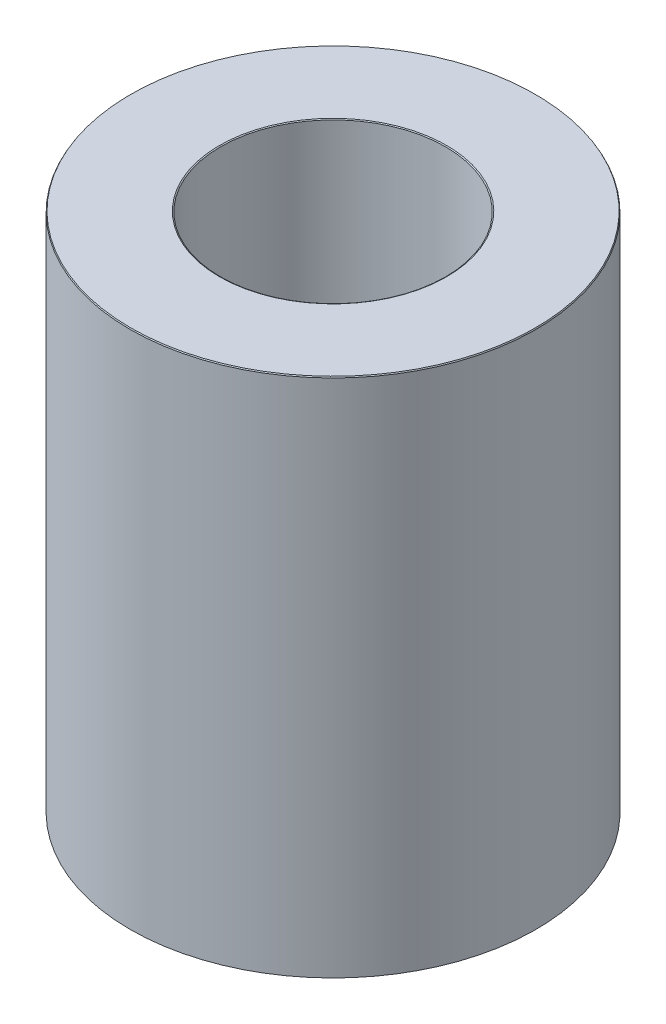
ISO-10303-21;
HEADER;
FILE_DESCRIPTION(('STEP AP214'),'2;1');
FILE_NAME('part.step','',(''),(''),'','','');
FILE_SCHEMA(('AUTOMOTIVE_DESIGN { 1 0 10303 214 1 1 1 1 }'));
ENDSEC;
DATA;
#1=APPLICATION_CONTEXT('core data for automotive mechanical design processes');
#2=APPLICATION_PROTOCOL_DEFINITION('international standard','automotive_design',2000,#1);
#3=PRODUCT_CONTEXT('',#1,'mechanical');
#4=PRODUCT('Part','Part','',(#3));
#5=PRODUCT_RELATED_PRODUCT_CATEGORY('part','',(#4));
#6=PRODUCT_DEFINITION_FORMATION('','',#4);
#7=PRODUCT_DEFINITION_CONTEXT('part definition',#1,'design');
#8=PRODUCT_DEFINITION('design','',#6,#7);
#9=PRODUCT_DEFINITION_SHAPE('','',#8);
#10=(LENGTH_UNIT() NAMED_UNIT(*) SI_UNIT(.MILLI.,.METRE.));
#11=(NAMED_UNIT(*) PLANE_ANGLE_UNIT() SI_UNIT($,.RADIAN.));
#12=(NAMED_UNIT(*) SI_UNIT($,.STERADIAN.) SOLID_ANGLE_UNIT());
#13=UNCERTAINTY_MEASURE_WITH_UNIT(LENGTH_MEASURE(1.E-05),#10,'distance_accuracy_value','');
#14=(GEOMETRIC_REPRESENTATION_CONTEXT(3) GLOBAL_UNCERTAINTY_ASSIGNED_CONTEXT((#13)) GLOBAL_UNIT_ASSIGNED_CONTEXT((#10,
#11,#12)) REPRESENTATION_CONTEXT('',''));
#15=CARTESIAN_POINT('',(0.,0.,0.));
#16=DIRECTION('',(0.,0.,1.));
#17=DIRECTION('',(1.,0.,0.));
#18=AXIS2_PLACEMENT_3D('',#15,#16,#17);
#19=CARTESIAN_POINT('',(0.,115.612034610415,0.));
#20=DIRECTION('',(0.,-1.,0.));
#21=DIRECTION('',(0.,0.,-1.));
#22=AXIS2_PLACEMENT_3D('',#19,#20,#21);
#23=CYLINDRICAL_SURFACE('',#22,45.);
#24=CARTESIAN_POINT('',(0.,0.136149137585848,0.));
#25=DIRECTION('',(0.,1.,0.));
#26=DIRECTION('',(0.,0.,1.));
#27=AXIS2_PLACEMENT_3D('',#24,#25,#26);
#28=CIRCLE('',#27,45.);
#29=CARTESIAN_POINT('',(0.,0.136149137585848,45.));
#30=VERTEX_POINT('',#29);
#31=EDGE_CURVE('E10',#30,#30,#28,.T.);
#32=ORIENTED_EDGE('',*,*,#31,.T.);
#33=EDGE_LOOP('',(#32));
#34=FACE_BOUND('',#33,.T.);
#35=CARTESIAN_POINT('',(0.,115.37621738671,0.));
#36=DIRECTION('',(0.,1.,0.));
#37=DIRECTION('',(0.,0.,1.));
#38=AXIS2_PLACEMENT_3D('',#35,#36,#37);
#39=CIRCLE('',#38,45.);
#40=CARTESIAN_POINT('',(0.,115.37621738671,45.));
#41=VERTEX_POINT('',#40);
#42=EDGE_CURVE('E50',#41,#41,#39,.F.);
#43=ORIENTED_EDGE('',*,*,#42,.T.);
#44=EDGE_LOOP('',(#43));
#45=FACE_BOUND('',#44,.T.);
#46=ADVANCED_FACE('F39',(#34,#45),#23,.T.);
#47=CARTESIAN_POINT('',(0.,115.612034610415,0.));
#48=DIRECTION('',(0.,1.,0.));
#49=DIRECTION('',(0.,0.,1.));
#50=AXIS2_PLACEMENT_3D('',#47,#48,#49);
#51=PLANE('',#50);
#52=CARTESIAN_POINT('',(0.,115.612034610415,0.));
#53=DIRECTION('',(0.,1.,0.));
#54=DIRECTION('',(0.,0.,1.));
#55=AXIS2_PLACEMENT_3D('',#52,#53,#54);
#56=CIRCLE('',#55,25.2085494652502);
#57=CARTESIAN_POINT('',(0.,115.612034610415,25.2085494652502));
#58=VERTEX_POINT('',#57);
#59=EDGE_CURVE('E58',#58,#58,#56,.F.);
#60=ORIENTED_EDGE('',*,*,#59,.T.);
#61=EDGE_LOOP('',(#60));
#62=FACE_BOUND('',#61,.T.);
#63=CARTESIAN_POINT('',(0.,115.612034610415,0.));
#64=DIRECTION('',(0.,1.,0.));
#65=DIRECTION('',(0.,0.,1.));
#66=AXIS2_PLACEMENT_3D('',#63,#64,#65);
#67=CIRCLE('',#66,44.8638508624142);
#68=CARTESIAN_POINT('',(0.,115.612034610415,44.8638508624142));
#69=VERTEX_POINT('',#68);
#70=EDGE_CURVE('E61',#69,#69,#67,.T.);
#71=ORIENTED_EDGE('',*,*,#70,.T.);
#72=EDGE_LOOP('',(#71));
#73=FACE_BOUND('',#72,.T.);
#74=ADVANCED_FACE('F88',(#62,#73),#51,.T.);
#75=CARTESIAN_POINT('',(0.,0.,0.));
#76=DIRECTION('',(0.,1.,0.));
#77=DIRECTION('',(0.,0.,1.));
#78=AXIS2_PLACEMENT_3D('',#75,#76,#77);
#79=PLANE('',#78);
#80=CARTESIAN_POINT('',(0.,0.,0.));
#81=DIRECTION('',(0.,1.,0.));
#82=DIRECTION('',(0.,0.,1.));
#83=AXIS2_PLACEMENT_3D('',#80,#81,#82);
#84=CIRCLE('',#83,25.1088813791307);
#85=CARTESIAN_POINT('',(0.,0.,25.1088813791307));
#86=VERTEX_POINT('',#85);
#87=EDGE_CURVE('E51',#86,#86,#84,.T.);
#88=ORIENTED_EDGE('',*,*,#87,.T.);
#89=EDGE_LOOP('',(#88));
#90=FACE_BOUND('',#89,.T.);
#91=CARTESIAN_POINT('',(0.,0.,0.));
#92=DIRECTION('',(0.,1.,0.));
#93=DIRECTION('',(0.,0.,1.));
#94=AXIS2_PLACEMENT_3D('',#91,#92,#93);
#95=CIRCLE('',#94,44.7641827762946);
#96=CARTESIAN_POINT('',(0.,0.,44.7641827762946));
#97=VERTEX_POINT('',#96);
#98=EDGE_CURVE('E54',#97,#97,#95,.F.);
#99=ORIENTED_EDGE('',*,*,#98,.T.);
#100=EDGE_LOOP('',(#99));
#101=FACE_BOUND('',#100,.T.);
#102=ADVANCED_FACE('F83',(#90,#101),#79,.F.);
#103=CARTESIAN_POINT('',(0.,115.612034610415,0.));
#104=DIRECTION('',(0.,-1.,0.));
#105=DIRECTION('',(0.,0.,-1.));
#106=AXIS2_PLACEMENT_3D('',#103,#104,#105);
#107=CYLINDRICAL_SURFACE('',#106,24.9727322415448);
#108=CARTESIAN_POINT('',(0.,115.475885472829,0.));
#109=DIRECTION('',(0.,1.,0.));
#110=DIRECTION('',(0.,0.,1.));
#111=AXIS2_PLACEMENT_3D('',#108,#109,#110);
#112=CIRCLE('',#111,24.9727322415448);
#113=CARTESIAN_POINT('',(0.,115.475885472829,24.9727322415448));
#114=VERTEX_POINT('',#113);
#115=EDGE_CURVE('E67',#114,#114,#112,.T.);
#116=ORIENTED_EDGE('',*,*,#115,.T.);
#117=EDGE_LOOP('',(#116));
#118=FACE_BOUND('',#117,.T.);
#119=CARTESIAN_POINT('',(0.,0.235817223705415,0.));
#120=DIRECTION('',(0.,1.,0.));
#121=DIRECTION('',(0.,0.,1.));
#122=AXIS2_PLACEMENT_3D('',#119,#120,#121);
#123=CIRCLE('',#122,24.9727322415448);
#124=CARTESIAN_POINT('',(0.,0.235817223705415,24.9727322415448));
#125=VERTEX_POINT('',#124);
#126=EDGE_CURVE('E69',#125,#125,#123,.F.);
#127=ORIENTED_EDGE('',*,*,#126,.T.);
#128=EDGE_LOOP('',(#127));
#129=FACE_BOUND('',#128,.T.);
#130=ADVANCED_FACE('F71',(#118,#129),#107,.F.);
#131=CARTESIAN_POINT('',(0.,115.475885472829,0.));
#132=DIRECTION('',(0.,1.,0.));
#133=DIRECTION('',(0.,0.,1.));
#134=AXIS2_PLACEMENT_3D('',#131,#132,#133);
#135=CONICAL_SURFACE('',#134,24.9727322415448,1.04719755119661);
#136=ORIENTED_EDGE('',*,*,#59,.F.);
#137=EDGE_LOOP('',(#136));
#138=FACE_BOUND('',#137,.T.);
#139=ORIENTED_EDGE('',*,*,#115,.F.);
#140=EDGE_LOOP('',(#139));
#141=FACE_BOUND('',#140,.T.);
#142=ADVANCED_FACE('F77',(#138,#141),#135,.F.);
#143=CARTESIAN_POINT('',(0.,0.,0.));
#144=DIRECTION('',(0.,-1.,0.));
#145=DIRECTION('',(0.,0.,-1.));
#146=AXIS2_PLACEMENT_3D('',#143,#144,#145);
#147=CONICAL_SURFACE('',#146,25.1088813791307,0.523598775598278);
#148=ORIENTED_EDGE('',*,*,#126,.F.);
#149=EDGE_LOOP('',(#148));
#150=FACE_BOUND('',#149,.T.);
#151=ORIENTED_EDGE('',*,*,#87,.F.);
#152=EDGE_LOOP('',(#151));
#153=FACE_BOUND('',#152,.T.);
#154=ADVANCED_FACE('F73',(#150,#153),#147,.F.);
#155=CARTESIAN_POINT('',(0.,0.136149137585848,0.));
#156=DIRECTION('',(0.,1.,0.));
#157=DIRECTION('',(0.,0.,1.));
#158=AXIS2_PLACEMENT_3D('',#155,#156,#157);
#159=CONICAL_SURFACE('',#158,45.,1.04719755119661);
#160=ORIENTED_EDGE('',*,*,#98,.F.);
#161=EDGE_LOOP('',(#160));
#162=FACE_BOUND('',#161,.T.);
#163=ORIENTED_EDGE('',*,*,#31,.F.);
#164=EDGE_LOOP('',(#163));
#165=FACE_BOUND('',#164,.T.);
#166=ADVANCED_FACE('F76',(#162,#165),#159,.T.);
#167=CARTESIAN_POINT('',(0.,115.612034610415,0.));
#168=DIRECTION('',(0.,-1.,0.));
#169=DIRECTION('',(0.,0.,-1.));
#170=AXIS2_PLACEMENT_3D('',#167,#168,#169);
#171=CONICAL_SURFACE('',#170,44.8638508624142,0.523598775598322);
#172=ORIENTED_EDGE('',*,*,#42,.F.);
#173=EDGE_LOOP('',(#172));
#174=FACE_BOUND('',#173,.T.);
#175=ORIENTED_EDGE('',*,*,#70,.F.);
#176=EDGE_LOOP('',(#175));
#177=FACE_BOUND('',#176,.T.);
#178=ADVANCED_FACE('F45',(#174,#177),#171,.T.);
#179=CLOSED_SHELL('',(#46,#74,#102,#130,#142,#154,#166,#178));
#180=MANIFOLD_SOLID_BREP('B2',#179);
#181=ADVANCED_BREP_SHAPE_REPRESENTATION('',(#18,#180),#14);
#182=SHAPE_DEFINITION_REPRESENTATION(#9,#181);
ENDSEC;
END-ISO-10303-21;
